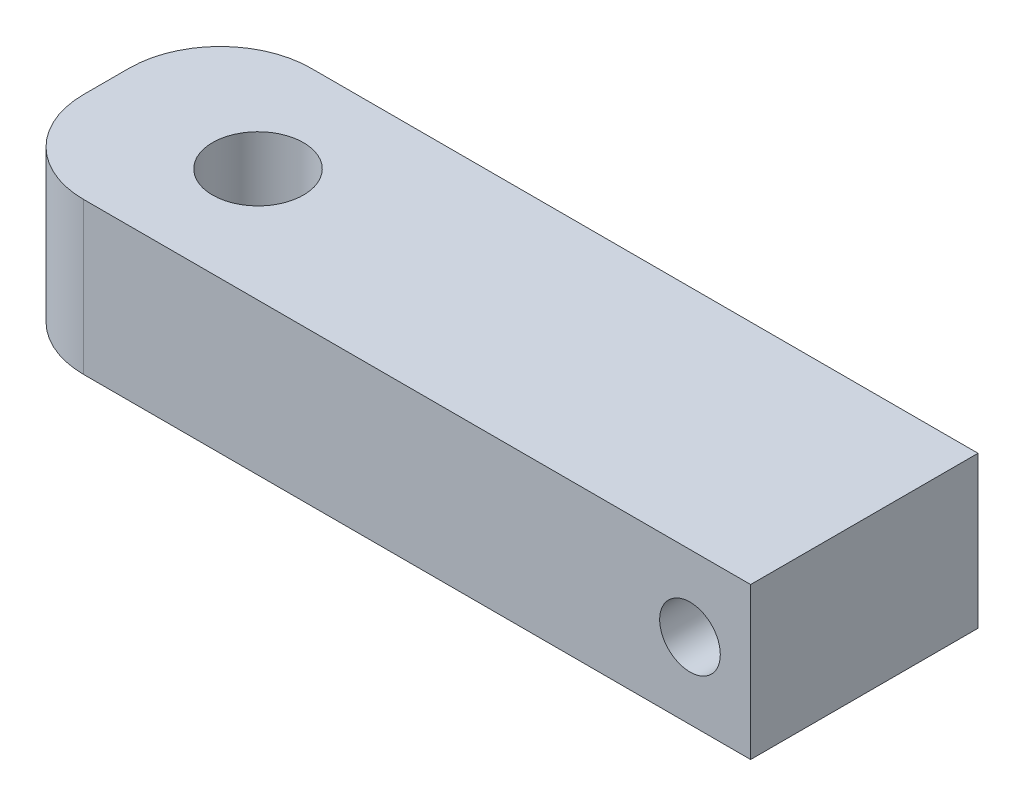
ISO-10303-21;
HEADER;
FILE_DESCRIPTION(('STEP AP214'),'2;1');
FILE_NAME('part.step','',(''),(''),'','','');
FILE_SCHEMA(('AUTOMOTIVE_DESIGN { 1 0 10303 214 1 1 1 1 }'));
ENDSEC;
DATA;
#1=APPLICATION_CONTEXT('core data for automotive mechanical design processes');
#2=APPLICATION_PROTOCOL_DEFINITION('international standard','automotive_design',2000,#1);
#3=PRODUCT_CONTEXT('',#1,'mechanical');
#4=PRODUCT('Part','Part','',(#3));
#5=PRODUCT_RELATED_PRODUCT_CATEGORY('part','',(#4));
#6=PRODUCT_DEFINITION_FORMATION('','',#4);
#7=PRODUCT_DEFINITION_CONTEXT('part definition',#1,'design');
#8=PRODUCT_DEFINITION('design','',#6,#7);
#9=PRODUCT_DEFINITION_SHAPE('','',#8);
#10=(LENGTH_UNIT() NAMED_UNIT(*) SI_UNIT(.MILLI.,.METRE.));
#11=(NAMED_UNIT(*) PLANE_ANGLE_UNIT() SI_UNIT($,.RADIAN.));
#12=(NAMED_UNIT(*) SI_UNIT($,.STERADIAN.) SOLID_ANGLE_UNIT());
#13=UNCERTAINTY_MEASURE_WITH_UNIT(LENGTH_MEASURE(1.E-05),#10,'distance_accuracy_value','');
#14=(GEOMETRIC_REPRESENTATION_CONTEXT(3) GLOBAL_UNCERTAINTY_ASSIGNED_CONTEXT((#13)) GLOBAL_UNIT_ASSIGNED_CONTEXT((#10,
#11,#12)) REPRESENTATION_CONTEXT('',''));
#15=CARTESIAN_POINT('',(0.,0.,0.));
#16=DIRECTION('',(0.,0.,1.));
#17=DIRECTION('',(1.,0.,0.));
#18=AXIS2_PLACEMENT_3D('',#15,#16,#17);
#19=CARTESIAN_POINT('',(0.,0.,19.05));
#20=DIRECTION('',(0.,0.,1.));
#21=DIRECTION('',(1.,0.,0.));
#22=AXIS2_PLACEMENT_3D('',#19,#20,#21);
#23=PLANE('',#22);
#24=DIRECTION('',(-1.,0.,0.));
#25=VECTOR('',#24,1.);
#26=CARTESIAN_POINT('',(-31.75,6.35,19.05));
#27=LINE('',#26,#25);
#28=CARTESIAN_POINT('',(31.75,6.35,19.05));
#29=VERTEX_POINT('',#28);
#30=CARTESIAN_POINT('',(-24.13,6.35,19.05));
#31=VERTEX_POINT('',#30);
#32=EDGE_CURVE('E121',#29,#31,#27,.T.);
#33=ORIENTED_EDGE('',*,*,#32,.T.);
#34=DIRECTION('',(0.,-1.,0.));
#35=VECTOR('',#34,1.);
#36=CARTESIAN_POINT('',(-24.13,-6.35,19.05));
#37=LINE('',#36,#35);
#38=CARTESIAN_POINT('',(-24.13,-6.35,19.05));
#39=VERTEX_POINT('',#38);
#40=EDGE_CURVE('E102',#31,#39,#37,.T.);
#41=ORIENTED_EDGE('',*,*,#40,.T.);
#42=DIRECTION('',(1.,0.,0.));
#43=VECTOR('',#42,1.);
#44=CARTESIAN_POINT('',(-31.75,-6.35,19.05));
#45=LINE('',#44,#43);
#46=CARTESIAN_POINT('',(31.75,-6.35,19.05));
#47=VERTEX_POINT('',#46);
#48=EDGE_CURVE('E94',#39,#47,#45,.T.);
#49=ORIENTED_EDGE('',*,*,#48,.T.);
#50=DIRECTION('',(0.,1.,0.));
#51=VECTOR('',#50,1.);
#52=CARTESIAN_POINT('',(31.75,6.35,19.05));
#53=LINE('',#52,#51);
#54=EDGE_CURVE('E99',#47,#29,#53,.T.);
#55=ORIENTED_EDGE('',*,*,#54,.T.);
#56=EDGE_LOOP('',(#33,#41,#49,#55));
#57=FACE_BOUND('',#56,.T.);
#58=CARTESIAN_POINT('',(26.67,0.,19.05));
#59=DIRECTION('',(0.,0.,1.));
#60=DIRECTION('',(1.,0.,0.));
#61=AXIS2_PLACEMENT_3D('',#58,#59,#60);
#62=CIRCLE('',#61,2.54);
#63=CARTESIAN_POINT('',(29.21,0.,19.05));
#64=VERTEX_POINT('',#63);
#65=EDGE_CURVE('E131',#64,#64,#62,.T.);
#66=ORIENTED_EDGE('',*,*,#65,.F.);
#67=EDGE_LOOP('',(#66));
#68=FACE_BOUND('',#67,.T.);
#69=ADVANCED_FACE('F39',(#57,#68),#23,.T.);
#70=CARTESIAN_POINT('',(0.,0.,0.));
#71=DIRECTION('',(0.,0.,1.));
#72=DIRECTION('',(1.,0.,0.));
#73=AXIS2_PLACEMENT_3D('',#70,#71,#72);
#74=PLANE('',#73);
#75=DIRECTION('',(1.,0.,0.));
#76=VECTOR('',#75,1.);
#77=CARTESIAN_POINT('',(-31.75,-6.35,0.));
#78=LINE('',#77,#76);
#79=CARTESIAN_POINT('',(-24.13,-6.35,0.));
#80=VERTEX_POINT('',#79);
#81=CARTESIAN_POINT('',(31.75,-6.35,0.));
#82=VERTEX_POINT('',#81);
#83=EDGE_CURVE('E110',#80,#82,#78,.T.);
#84=ORIENTED_EDGE('',*,*,#83,.F.);
#85=DIRECTION('',(0.,-1.,0.));
#86=VECTOR('',#85,1.);
#87=CARTESIAN_POINT('',(-24.13,0.,0.));
#88=LINE('',#87,#86);
#89=CARTESIAN_POINT('',(-24.13,6.35,0.));
#90=VERTEX_POINT('',#89);
#91=EDGE_CURVE('E11',#80,#90,#88,.F.);
#92=ORIENTED_EDGE('',*,*,#91,.T.);
#93=DIRECTION('',(-1.,0.,0.));
#94=VECTOR('',#93,1.);
#95=CARTESIAN_POINT('',(-31.75,6.35,0.));
#96=LINE('',#95,#94);
#97=CARTESIAN_POINT('',(31.75,6.35,0.));
#98=VERTEX_POINT('',#97);
#99=EDGE_CURVE('E105',#98,#90,#96,.T.);
#100=ORIENTED_EDGE('',*,*,#99,.F.);
#101=DIRECTION('',(0.,1.,0.));
#102=VECTOR('',#101,1.);
#103=CARTESIAN_POINT('',(31.75,6.35,0.));
#104=LINE('',#103,#102);
#105=EDGE_CURVE('E130',#82,#98,#104,.T.);
#106=ORIENTED_EDGE('',*,*,#105,.F.);
#107=EDGE_LOOP('',(#84,#92,#100,#106));
#108=FACE_BOUND('',#107,.T.);
#109=CARTESIAN_POINT('',(26.67,0.,0.));
#110=DIRECTION('',(0.,0.,1.));
#111=DIRECTION('',(1.,0.,0.));
#112=AXIS2_PLACEMENT_3D('',#109,#110,#111);
#113=CIRCLE('',#112,2.54);
#114=CARTESIAN_POINT('',(29.21,0.,0.));
#115=VERTEX_POINT('',#114);
#116=EDGE_CURVE('E176',#115,#115,#113,.T.);
#117=ORIENTED_EDGE('',*,*,#116,.T.);
#118=EDGE_LOOP('',(#117));
#119=FACE_BOUND('',#118,.T.);
#120=ADVANCED_FACE('F170',(#108,#119),#74,.F.);
#121=CARTESIAN_POINT('',(-31.75,6.35,19.05));
#122=DIRECTION('',(1.,0.,0.));
#123=DIRECTION('',(0.,0.,-1.));
#124=AXIS2_PLACEMENT_3D('',#121,#122,#123);
#125=PLANE('',#124);
#126=DIRECTION('',(0.,0.,-1.));
#127=VECTOR('',#126,1.);
#128=CARTESIAN_POINT('',(-31.75,-6.35,19.05));
#129=LINE('',#128,#127);
#130=CARTESIAN_POINT('',(-31.75,-6.35,11.43));
#131=VERTEX_POINT('',#130);
#132=CARTESIAN_POINT('',(-31.75,-6.35,7.62));
#133=VERTEX_POINT('',#132);
#134=EDGE_CURVE('E114',#131,#133,#129,.T.);
#135=ORIENTED_EDGE('',*,*,#134,.F.);
#136=DIRECTION('',(0.,-1.,0.));
#137=VECTOR('',#136,1.);
#138=CARTESIAN_POINT('',(-31.75,6.35,11.43));
#139=LINE('',#138,#137);
#140=CARTESIAN_POINT('',(-31.75,6.35,11.43));
#141=VERTEX_POINT('',#140);
#142=EDGE_CURVE('E155',#131,#141,#139,.F.);
#143=ORIENTED_EDGE('',*,*,#142,.T.);
#144=DIRECTION('',(0.,0.,-1.));
#145=VECTOR('',#144,1.);
#146=CARTESIAN_POINT('',(-31.75,6.35,19.05));
#147=LINE('',#146,#145);
#148=CARTESIAN_POINT('',(-31.75,6.35,7.62));
#149=VERTEX_POINT('',#148);
#150=EDGE_CURVE('E124',#141,#149,#147,.T.);
#151=ORIENTED_EDGE('',*,*,#150,.T.);
#152=DIRECTION('',(0.,-1.,0.));
#153=VECTOR('',#152,1.);
#154=CARTESIAN_POINT('',(-31.75,6.35,7.62));
#155=LINE('',#154,#153);
#156=EDGE_CURVE('E151',#149,#133,#155,.T.);
#157=ORIENTED_EDGE('',*,*,#156,.T.);
#158=EDGE_LOOP('',(#135,#143,#151,#157));
#159=FACE_BOUND('',#158,.T.);
#160=ADVANCED_FACE('F167',(#159),#125,.F.);
#161=CARTESIAN_POINT('',(-31.75,-6.35,19.05));
#162=DIRECTION('',(0.,1.,0.));
#163=DIRECTION('',(-1.,0.,0.));
#164=AXIS2_PLACEMENT_3D('',#161,#162,#163);
#165=PLANE('',#164);
#166=CARTESIAN_POINT('',(-19.05,-6.35,9.525));
#167=DIRECTION('',(0.,1.,0.));
#168=DIRECTION('',(-1.,0.,0.));
#169=AXIS2_PLACEMENT_3D('',#166,#167,#168);
#170=CIRCLE('',#169,3.81);
#171=CARTESIAN_POINT('',(-22.86,-6.35,9.525));
#172=VERTEX_POINT('',#171);
#173=EDGE_CURVE('E179',#172,#172,#170,.F.);
#174=ORIENTED_EDGE('',*,*,#173,.F.);
#175=EDGE_LOOP('',(#174));
#176=FACE_BOUND('',#175,.T.);
#177=ORIENTED_EDGE('',*,*,#48,.F.);
#178=CARTESIAN_POINT('',(-24.13,-6.35,11.43));
#179=DIRECTION('',(0.,1.,0.));
#180=DIRECTION('',(-1.,0.,0.));
#181=AXIS2_PLACEMENT_3D('',#178,#179,#180);
#182=CIRCLE('',#181,7.62);
#183=EDGE_CURVE('E148',#39,#131,#182,.F.);
#184=ORIENTED_EDGE('',*,*,#183,.T.);
#185=ORIENTED_EDGE('',*,*,#134,.T.);
#186=CARTESIAN_POINT('',(-24.13,-6.35,7.62));
#187=DIRECTION('',(0.,1.,0.));
#188=DIRECTION('',(-1.,0.,0.));
#189=AXIS2_PLACEMENT_3D('',#186,#187,#188);
#190=CIRCLE('',#189,7.62);
#191=EDGE_CURVE('E145',#133,#80,#190,.F.);
#192=ORIENTED_EDGE('',*,*,#191,.T.);
#193=ORIENTED_EDGE('',*,*,#83,.T.);
#194=DIRECTION('',(0.,0.,-1.));
#195=VECTOR('',#194,1.);
#196=CARTESIAN_POINT('',(31.75,-6.35,19.05));
#197=LINE('',#196,#195);
#198=EDGE_CURVE('E108',#47,#82,#197,.T.);
#199=ORIENTED_EDGE('',*,*,#198,.F.);
#200=EDGE_LOOP('',(#177,#184,#185,#192,#193,#199));
#201=FACE_BOUND('',#200,.T.);
#202=ADVANCED_FACE('F109',(#176,#201),#165,.F.);
#203=CARTESIAN_POINT('',(31.75,6.35,19.05));
#204=DIRECTION('',(-1.,0.,0.));
#205=DIRECTION('',(0.,0.,1.));
#206=AXIS2_PLACEMENT_3D('',#203,#204,#205);
#207=PLANE('',#206);
#208=ORIENTED_EDGE('',*,*,#105,.T.);
#209=DIRECTION('',(0.,0.,-1.));
#210=VECTOR('',#209,1.);
#211=CARTESIAN_POINT('',(31.75,6.35,19.05));
#212=LINE('',#211,#210);
#213=EDGE_CURVE('E115',#29,#98,#212,.T.);
#214=ORIENTED_EDGE('',*,*,#213,.F.);
#215=ORIENTED_EDGE('',*,*,#54,.F.);
#216=ORIENTED_EDGE('',*,*,#198,.T.);
#217=EDGE_LOOP('',(#208,#214,#215,#216));
#218=FACE_BOUND('',#217,.T.);
#219=ADVANCED_FACE('F117',(#218),#207,.F.);
#220=CARTESIAN_POINT('',(-31.75,6.35,19.05));
#221=DIRECTION('',(0.,-1.,0.));
#222=DIRECTION('',(0.,0.,-1.));
#223=AXIS2_PLACEMENT_3D('',#220,#221,#222);
#224=PLANE('',#223);
#225=CARTESIAN_POINT('',(-19.05,6.35,9.525));
#226=DIRECTION('',(0.,1.,0.));
#227=DIRECTION('',(0.,0.,1.));
#228=AXIS2_PLACEMENT_3D('',#225,#226,#227);
#229=CIRCLE('',#228,3.81);
#230=CARTESIAN_POINT('',(-19.05,6.35,13.335));
#231=VERTEX_POINT('',#230);
#232=EDGE_CURVE('E185',#231,#231,#229,.T.);
#233=ORIENTED_EDGE('',*,*,#232,.F.);
#234=EDGE_LOOP('',(#233));
#235=FACE_BOUND('',#234,.T.);
#236=ORIENTED_EDGE('',*,*,#150,.F.);
#237=CARTESIAN_POINT('',(-24.13,6.35,11.43));
#238=DIRECTION('',(0.,-1.,0.));
#239=DIRECTION('',(0.,0.,-1.));
#240=AXIS2_PLACEMENT_3D('',#237,#238,#239);
#241=CIRCLE('',#240,7.62);
#242=EDGE_CURVE('E48',#141,#31,#241,.F.);
#243=ORIENTED_EDGE('',*,*,#242,.T.);
#244=ORIENTED_EDGE('',*,*,#32,.F.);
#245=ORIENTED_EDGE('',*,*,#213,.T.);
#246=ORIENTED_EDGE('',*,*,#99,.T.);
#247=CARTESIAN_POINT('',(-24.13,6.35,7.62));
#248=DIRECTION('',(0.,-1.,0.));
#249=DIRECTION('',(0.,0.,-1.));
#250=AXIS2_PLACEMENT_3D('',#247,#248,#249);
#251=CIRCLE('',#250,7.62);
#252=EDGE_CURVE('E60',#90,#149,#251,.F.);
#253=ORIENTED_EDGE('',*,*,#252,.T.);
#254=EDGE_LOOP('',(#236,#243,#244,#245,#246,#253));
#255=FACE_BOUND('',#254,.T.);
#256=ADVANCED_FACE('F161',(#235,#255),#224,.F.);
#257=CARTESIAN_POINT('',(26.67,0.,19.05));
#258=DIRECTION('',(0.,0.,-1.));
#259=DIRECTION('',(-1.,0.,0.));
#260=AXIS2_PLACEMENT_3D('',#257,#258,#259);
#261=CYLINDRICAL_SURFACE('',#260,2.54);
#262=ORIENTED_EDGE('',*,*,#65,.T.);
#263=EDGE_LOOP('',(#262));
#264=FACE_BOUND('',#263,.T.);
#265=ORIENTED_EDGE('',*,*,#116,.F.);
#266=EDGE_LOOP('',(#265));
#267=FACE_BOUND('',#266,.T.);
#268=ADVANCED_FACE('F196',(#264,#267),#261,.F.);
#269=CARTESIAN_POINT('',(-19.05,-6.351,9.525));
#270=DIRECTION('',(0.,1.,0.));
#271=DIRECTION('',(0.,0.,1.));
#272=AXIS2_PLACEMENT_3D('',#269,#270,#271);
#273=CYLINDRICAL_SURFACE('',#272,3.81);
#274=ORIENTED_EDGE('',*,*,#232,.T.);
#275=EDGE_LOOP('',(#274));
#276=FACE_BOUND('',#275,.T.);
#277=ORIENTED_EDGE('',*,*,#173,.T.);
#278=EDGE_LOOP('',(#277));
#279=FACE_BOUND('',#278,.T.);
#280=ADVANCED_FACE('F192',(#276,#279),#273,.F.);
#281=CARTESIAN_POINT('',(-24.13,0.,11.43));
#282=DIRECTION('',(0.,1.,0.));
#283=DIRECTION('',(0.,0.,1.));
#284=AXIS2_PLACEMENT_3D('',#281,#282,#283);
#285=CYLINDRICAL_SURFACE('',#284,7.62);
#286=ORIENTED_EDGE('',*,*,#242,.F.);
#287=ORIENTED_EDGE('',*,*,#142,.F.);
#288=ORIENTED_EDGE('',*,*,#183,.F.);
#289=ORIENTED_EDGE('',*,*,#40,.F.);
#290=EDGE_LOOP('',(#286,#287,#288,#289));
#291=FACE_BOUND('',#290,.T.);
#292=ADVANCED_FACE('F164',(#291),#285,.T.);
#293=CARTESIAN_POINT('',(-24.13,6.35,7.62));
#294=DIRECTION('',(0.,-1.,0.));
#295=DIRECTION('',(0.,0.,-1.));
#296=AXIS2_PLACEMENT_3D('',#293,#294,#295);
#297=CYLINDRICAL_SURFACE('',#296,7.62);
#298=ORIENTED_EDGE('',*,*,#252,.F.);
#299=ORIENTED_EDGE('',*,*,#91,.F.);
#300=ORIENTED_EDGE('',*,*,#191,.F.);
#301=ORIENTED_EDGE('',*,*,#156,.F.);
#302=EDGE_LOOP('',(#298,#299,#300,#301));
#303=FACE_BOUND('',#302,.T.);
#304=ADVANCED_FACE('F41',(#303),#297,.T.);
#305=CLOSED_SHELL('',(#69,#120,#160,#202,#219,#256,#268,#280,#292,#304));
#306=MANIFOLD_SOLID_BREP('B2',#305);
#307=ADVANCED_BREP_SHAPE_REPRESENTATION('',(#18,#306),#14);
#308=SHAPE_DEFINITION_REPRESENTATION(#9,#307);
ENDSEC;
END-ISO-10303-21;
